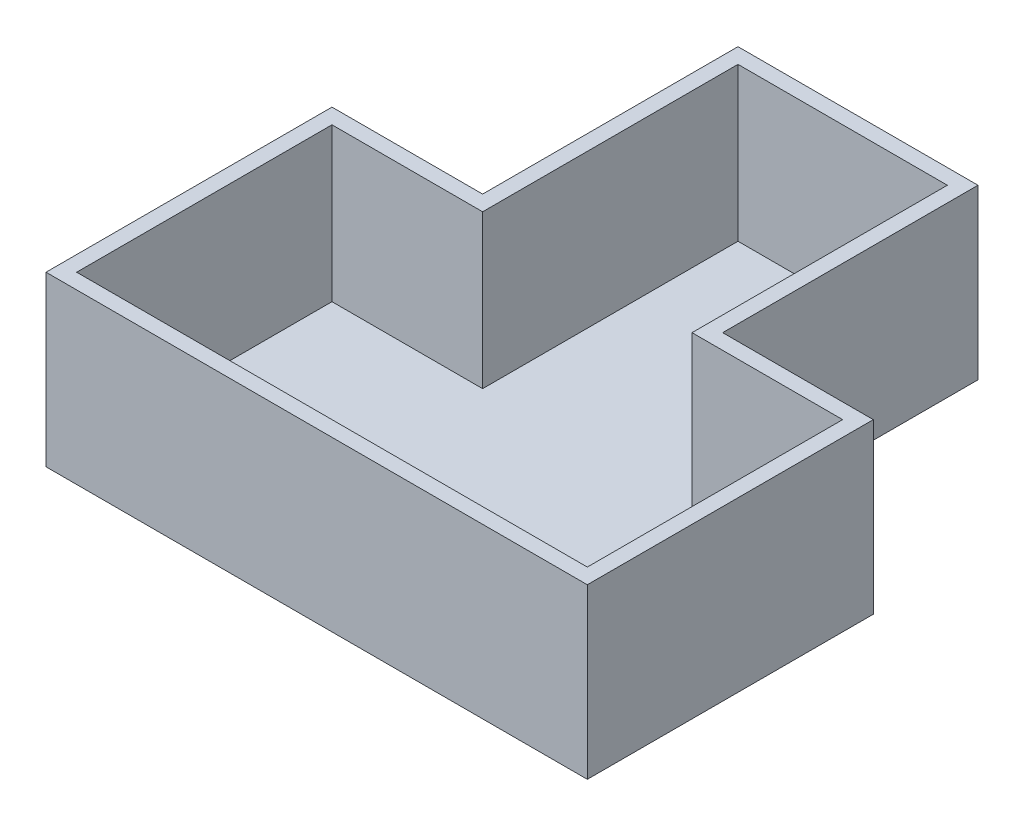
ISO-10303-21;
HEADER;
FILE_DESCRIPTION(('STEP AP214'),'2;1');
FILE_NAME('part.step','',(''),(''),'','','');
FILE_SCHEMA(('AUTOMOTIVE_DESIGN { 1 0 10303 214 1 1 1 1 }'));
ENDSEC;
DATA;
#1=APPLICATION_CONTEXT('core data for automotive mechanical design processes');
#2=APPLICATION_PROTOCOL_DEFINITION('international standard','automotive_design',2000,#1);
#3=PRODUCT_CONTEXT('',#1,'mechanical');
#4=PRODUCT('Part','Part','',(#3));
#5=PRODUCT_RELATED_PRODUCT_CATEGORY('part','',(#4));
#6=PRODUCT_DEFINITION_FORMATION('','',#4);
#7=PRODUCT_DEFINITION_CONTEXT('part definition',#1,'design');
#8=PRODUCT_DEFINITION('design','',#6,#7);
#9=PRODUCT_DEFINITION_SHAPE('','',#8);
#10=(LENGTH_UNIT() NAMED_UNIT(*) SI_UNIT(.MILLI.,.METRE.));
#11=(NAMED_UNIT(*) PLANE_ANGLE_UNIT() SI_UNIT($,.RADIAN.));
#12=(NAMED_UNIT(*) SI_UNIT($,.STERADIAN.) SOLID_ANGLE_UNIT());
#13=UNCERTAINTY_MEASURE_WITH_UNIT(LENGTH_MEASURE(1.E-05),#10,'distance_accuracy_value','');
#14=(GEOMETRIC_REPRESENTATION_CONTEXT(3) GLOBAL_UNCERTAINTY_ASSIGNED_CONTEXT((#13)) GLOBAL_UNIT_ASSIGNED_CONTEXT((#10,
#11,#12)) REPRESENTATION_CONTEXT('',''));
#15=CARTESIAN_POINT('',(0.,0.,0.));
#16=DIRECTION('',(0.,0.,1.));
#17=DIRECTION('',(1.,0.,0.));
#18=AXIS2_PLACEMENT_3D('',#15,#16,#17);
#19=CARTESIAN_POINT('',(-20.5,30.,-1.99404761904756));
#20=DIRECTION('',(0.,0.,1.));
#21=DIRECTION('',(1.,0.,0.));
#22=AXIS2_PLACEMENT_3D('',#19,#20,#21);
#23=PLANE('',#22);
#24=DIRECTION('',(-1.,0.,0.));
#25=VECTOR('',#24,1.);
#26=CARTESIAN_POINT('',(-20.5,-3.,-1.99404761904756));
#27=LINE('',#26,#25);
#28=CARTESIAN_POINT('',(-23.5,-3.,-1.99404761904756));
#29=VERTEX_POINT('',#28);
#30=CARTESIAN_POINT('',(-53.,-3.,-1.99404761904755));
#31=VERTEX_POINT('',#30);
#32=EDGE_CURVE('E169',#29,#31,#27,.T.);
#33=ORIENTED_EDGE('',*,*,#32,.T.);
#34=DIRECTION('',(0.,-1.,0.));
#35=VECTOR('',#34,1.);
#36=CARTESIAN_POINT('',(-53.,30.,-1.99404761904755));
#37=LINE('',#36,#35);
#38=CARTESIAN_POINT('',(-53.,30.,-1.99404761904755));
#39=VERTEX_POINT('',#38);
#40=EDGE_CURVE('E11',#39,#31,#37,.T.);
#41=ORIENTED_EDGE('',*,*,#40,.F.);
#42=DIRECTION('',(-1.,0.,0.));
#43=VECTOR('',#42,1.);
#44=CARTESIAN_POINT('',(-20.5,30.,-1.99404761904756));
#45=LINE('',#44,#43);
#46=CARTESIAN_POINT('',(-23.5,30.,-1.99404761904756));
#47=VERTEX_POINT('',#46);
#48=EDGE_CURVE('E254',#47,#39,#45,.T.);
#49=ORIENTED_EDGE('',*,*,#48,.F.);
#50=DIRECTION('',(0.,-1.,0.));
#51=VECTOR('',#50,1.);
#52=CARTESIAN_POINT('',(-23.5,30.,-1.99404761904756));
#53=LINE('',#52,#51);
#54=EDGE_CURVE('E221',#47,#29,#53,.T.);
#55=ORIENTED_EDGE('',*,*,#54,.T.);
#56=EDGE_LOOP('',(#33,#41,#49,#55));
#57=FACE_BOUND('',#56,.T.);
#58=ADVANCED_FACE('F33',(#57),#23,.F.);
#59=CARTESIAN_POINT('',(-53.,30.,1.00595238095245));
#60=DIRECTION('',(1.,0.,0.));
#61=DIRECTION('',(0.,0.,-1.));
#62=AXIS2_PLACEMENT_3D('',#59,#60,#61);
#63=PLANE('',#62);
#64=DIRECTION('',(0.,0.,1.));
#65=VECTOR('',#64,1.);
#66=CARTESIAN_POINT('',(-53.,-3.,1.00595238095245));
#67=LINE('',#66,#65);
#68=CARTESIAN_POINT('',(-53.,-3.,54.0059523809525));
#69=VERTEX_POINT('',#68);
#70=EDGE_CURVE('E219',#31,#69,#67,.T.);
#71=ORIENTED_EDGE('',*,*,#70,.T.);
#72=DIRECTION('',(0.,-1.,0.));
#73=VECTOR('',#72,1.);
#74=CARTESIAN_POINT('',(-53.,30.,54.0059523809525));
#75=LINE('',#74,#73);
#76=CARTESIAN_POINT('',(-53.,30.,54.0059523809525));
#77=VERTEX_POINT('',#76);
#78=EDGE_CURVE('E42',#77,#69,#75,.T.);
#79=ORIENTED_EDGE('',*,*,#78,.F.);
#80=DIRECTION('',(0.,0.,1.));
#81=VECTOR('',#80,1.);
#82=CARTESIAN_POINT('',(-53.,30.,1.00595238095245));
#83=LINE('',#82,#81);
#84=EDGE_CURVE('E256',#39,#77,#83,.T.);
#85=ORIENTED_EDGE('',*,*,#84,.F.);
#86=ORIENTED_EDGE('',*,*,#40,.T.);
#87=EDGE_LOOP('',(#71,#79,#85,#86));
#88=FACE_BOUND('',#87,.T.);
#89=ADVANCED_FACE('F284',(#88),#63,.F.);
#90=CARTESIAN_POINT('',(-50.,30.,54.0059523809525));
#91=DIRECTION('',(0.,0.,-1.));
#92=DIRECTION('',(-1.,0.,0.));
#93=AXIS2_PLACEMENT_3D('',#90,#91,#92);
#94=PLANE('',#93);
#95=DIRECTION('',(1.,0.,0.));
#96=VECTOR('',#95,1.);
#97=CARTESIAN_POINT('',(-50.,-3.,54.0059523809525));
#98=LINE('',#97,#96);
#99=CARTESIAN_POINT('',(53.,-3.,54.0059523809524));
#100=VERTEX_POINT('',#99);
#101=EDGE_CURVE('E226',#69,#100,#98,.T.);
#102=ORIENTED_EDGE('',*,*,#101,.T.);
#103=DIRECTION('',(0.,-1.,0.));
#104=VECTOR('',#103,1.);
#105=CARTESIAN_POINT('',(53.,30.,54.0059523809524));
#106=LINE('',#105,#104);
#107=CARTESIAN_POINT('',(53.,30.,54.0059523809524));
#108=VERTEX_POINT('',#107);
#109=EDGE_CURVE('E229',#108,#100,#106,.T.);
#110=ORIENTED_EDGE('',*,*,#109,.F.);
#111=DIRECTION('',(1.,0.,0.));
#112=VECTOR('',#111,1.);
#113=CARTESIAN_POINT('',(-50.,30.,54.0059523809525));
#114=LINE('',#113,#112);
#115=EDGE_CURVE('E258',#77,#108,#114,.T.);
#116=ORIENTED_EDGE('',*,*,#115,.F.);
#117=ORIENTED_EDGE('',*,*,#78,.T.);
#118=EDGE_LOOP('',(#102,#110,#116,#117));
#119=FACE_BOUND('',#118,.T.);
#120=ADVANCED_FACE('F287',(#119),#94,.F.);
#121=CARTESIAN_POINT('',(53.,30.,1.00595238095243));
#122=DIRECTION('',(-1.,0.,0.));
#123=DIRECTION('',(0.,0.,1.));
#124=AXIS2_PLACEMENT_3D('',#121,#122,#123);
#125=PLANE('',#124);
#126=DIRECTION('',(0.,0.,-1.));
#127=VECTOR('',#126,1.);
#128=CARTESIAN_POINT('',(53.,-3.,1.00595238095243));
#129=LINE('',#128,#127);
#130=CARTESIAN_POINT('',(53.,-3.,-1.99404761904757));
#131=VERTEX_POINT('',#130);
#132=EDGE_CURVE('E231',#100,#131,#129,.T.);
#133=ORIENTED_EDGE('',*,*,#132,.T.);
#134=DIRECTION('',(0.,-1.,0.));
#135=VECTOR('',#134,1.);
#136=CARTESIAN_POINT('',(53.,30.,-1.99404761904757));
#137=LINE('',#136,#135);
#138=CARTESIAN_POINT('',(53.,30.,-1.99404761904757));
#139=VERTEX_POINT('',#138);
#140=EDGE_CURVE('E234',#139,#131,#137,.T.);
#141=ORIENTED_EDGE('',*,*,#140,.F.);
#142=DIRECTION('',(0.,0.,-1.));
#143=VECTOR('',#142,1.);
#144=CARTESIAN_POINT('',(53.,30.,1.00595238095243));
#145=LINE('',#144,#143);
#146=EDGE_CURVE('E260',#108,#139,#145,.T.);
#147=ORIENTED_EDGE('',*,*,#146,.F.);
#148=ORIENTED_EDGE('',*,*,#109,.T.);
#149=EDGE_LOOP('',(#133,#141,#147,#148));
#150=FACE_BOUND('',#149,.T.);
#151=ADVANCED_FACE('F292',(#150),#125,.F.);
#152=CARTESIAN_POINT('',(20.5,30.,-1.99404761904756));
#153=DIRECTION('',(0.,0.,1.));
#154=DIRECTION('',(1.,0.,0.));
#155=AXIS2_PLACEMENT_3D('',#152,#153,#154);
#156=PLANE('',#155);
#157=DIRECTION('',(-1.,0.,0.));
#158=VECTOR('',#157,1.);
#159=CARTESIAN_POINT('',(20.5,-3.,-1.99404761904756));
#160=LINE('',#159,#158);
#161=CARTESIAN_POINT('',(23.5,-3.,-1.99404761904756));
#162=VERTEX_POINT('',#161);
#163=EDGE_CURVE('E236',#131,#162,#160,.T.);
#164=ORIENTED_EDGE('',*,*,#163,.T.);
#165=DIRECTION('',(0.,-1.,0.));
#166=VECTOR('',#165,1.);
#167=CARTESIAN_POINT('',(23.5,30.,-1.99404761904756));
#168=LINE('',#167,#166);
#169=CARTESIAN_POINT('',(23.5,30.,-1.99404761904756));
#170=VERTEX_POINT('',#169);
#171=EDGE_CURVE('E239',#170,#162,#168,.T.);
#172=ORIENTED_EDGE('',*,*,#171,.F.);
#173=DIRECTION('',(-1.,0.,0.));
#174=VECTOR('',#173,1.);
#175=CARTESIAN_POINT('',(20.5,30.,-1.99404761904756));
#176=LINE('',#175,#174);
#177=EDGE_CURVE('E262',#139,#170,#176,.T.);
#178=ORIENTED_EDGE('',*,*,#177,.F.);
#179=ORIENTED_EDGE('',*,*,#140,.T.);
#180=EDGE_LOOP('',(#164,#172,#178,#179));
#181=FACE_BOUND('',#180,.T.);
#182=ADVANCED_FACE('F296',(#181),#156,.F.);
#183=CARTESIAN_POINT('',(23.5,30.,-48.9940476190476));
#184=DIRECTION('',(-1.,0.,0.));
#185=DIRECTION('',(0.,0.,1.));
#186=AXIS2_PLACEMENT_3D('',#183,#184,#185);
#187=PLANE('',#186);
#188=DIRECTION('',(0.,0.,-1.));
#189=VECTOR('',#188,1.);
#190=CARTESIAN_POINT('',(23.5,-3.,-48.9940476190476));
#191=LINE('',#190,#189);
#192=CARTESIAN_POINT('',(23.5,-3.,-51.9940476190476));
#193=VERTEX_POINT('',#192);
#194=EDGE_CURVE('E241',#162,#193,#191,.T.);
#195=ORIENTED_EDGE('',*,*,#194,.T.);
#196=DIRECTION('',(0.,-1.,0.));
#197=VECTOR('',#196,1.);
#198=CARTESIAN_POINT('',(23.5,30.,-51.9940476190476));
#199=LINE('',#198,#197);
#200=CARTESIAN_POINT('',(23.5,30.,-51.9940476190476));
#201=VERTEX_POINT('',#200);
#202=EDGE_CURVE('E244',#201,#193,#199,.T.);
#203=ORIENTED_EDGE('',*,*,#202,.F.);
#204=DIRECTION('',(0.,0.,-1.));
#205=VECTOR('',#204,1.);
#206=CARTESIAN_POINT('',(23.5,30.,-48.9940476190476));
#207=LINE('',#206,#205);
#208=EDGE_CURVE('E264',#170,#201,#207,.T.);
#209=ORIENTED_EDGE('',*,*,#208,.F.);
#210=ORIENTED_EDGE('',*,*,#171,.T.);
#211=EDGE_LOOP('',(#195,#203,#209,#210));
#212=FACE_BOUND('',#211,.T.);
#213=ADVANCED_FACE('F300',(#212),#187,.F.);
#214=CARTESIAN_POINT('',(20.5,30.,-51.9940476190476));
#215=DIRECTION('',(0.,0.,1.));
#216=DIRECTION('',(1.,0.,0.));
#217=AXIS2_PLACEMENT_3D('',#214,#215,#216);
#218=PLANE('',#217);
#219=DIRECTION('',(-1.,0.,0.));
#220=VECTOR('',#219,1.);
#221=CARTESIAN_POINT('',(20.5,-3.,-51.9940476190476));
#222=LINE('',#221,#220);
#223=CARTESIAN_POINT('',(-23.5,-3.,-51.9940476190476));
#224=VERTEX_POINT('',#223);
#225=EDGE_CURVE('E246',#193,#224,#222,.T.);
#226=ORIENTED_EDGE('',*,*,#225,.T.);
#227=DIRECTION('',(0.,-1.,0.));
#228=VECTOR('',#227,1.);
#229=CARTESIAN_POINT('',(-23.5,30.,-51.9940476190476));
#230=LINE('',#229,#228);
#231=CARTESIAN_POINT('',(-23.5,30.,-51.9940476190476));
#232=VERTEX_POINT('',#231);
#233=EDGE_CURVE('E224',#232,#224,#230,.T.);
#234=ORIENTED_EDGE('',*,*,#233,.F.);
#235=DIRECTION('',(-1.,0.,0.));
#236=VECTOR('',#235,1.);
#237=CARTESIAN_POINT('',(20.5,30.,-51.9940476190476));
#238=LINE('',#237,#236);
#239=EDGE_CURVE('E265',#201,#232,#238,.T.);
#240=ORIENTED_EDGE('',*,*,#239,.F.);
#241=ORIENTED_EDGE('',*,*,#202,.T.);
#242=EDGE_LOOP('',(#226,#234,#240,#241));
#243=FACE_BOUND('',#242,.T.);
#244=ADVANCED_FACE('F271',(#243),#218,.F.);
#245=CARTESIAN_POINT('',(-23.5,30.,-48.9940476190476));
#246=DIRECTION('',(1.,0.,0.));
#247=DIRECTION('',(0.,0.,-1.));
#248=AXIS2_PLACEMENT_3D('',#245,#246,#247);
#249=PLANE('',#248);
#250=DIRECTION('',(0.,0.,1.));
#251=VECTOR('',#250,1.);
#252=CARTESIAN_POINT('',(-23.5,-3.,-48.9940476190476));
#253=LINE('',#252,#251);
#254=EDGE_CURVE('E250',#224,#29,#253,.T.);
#255=ORIENTED_EDGE('',*,*,#254,.T.);
#256=ORIENTED_EDGE('',*,*,#54,.F.);
#257=DIRECTION('',(0.,0.,1.));
#258=VECTOR('',#257,1.);
#259=CARTESIAN_POINT('',(-23.5,30.,-48.9940476190476));
#260=LINE('',#259,#258);
#261=EDGE_CURVE('E37',#232,#47,#260,.T.);
#262=ORIENTED_EDGE('',*,*,#261,.F.);
#263=ORIENTED_EDGE('',*,*,#233,.T.);
#264=EDGE_LOOP('',(#255,#256,#262,#263));
#265=FACE_BOUND('',#264,.T.);
#266=ADVANCED_FACE('F275',(#265),#249,.F.);
#267=CARTESIAN_POINT('',(0.,30.,0.));
#268=DIRECTION('',(0.,1.,0.));
#269=DIRECTION('',(0.,0.,1.));
#270=AXIS2_PLACEMENT_3D('',#267,#268,#269);
#271=PLANE('',#270);
#272=DIRECTION('',(-1.,0.,0.));
#273=VECTOR('',#272,1.);
#274=CARTESIAN_POINT('',(-20.5,30.,1.00595238095244));
#275=LINE('',#274,#273);
#276=CARTESIAN_POINT('',(-20.5,30.,1.00595238095244));
#277=VERTEX_POINT('',#276);
#278=CARTESIAN_POINT('',(-50.,30.,1.00595238095245));
#279=VERTEX_POINT('',#278);
#280=EDGE_CURVE('E150',#277,#279,#275,.T.);
#281=ORIENTED_EDGE('',*,*,#280,.F.);
#282=DIRECTION('',(0.,0.,1.));
#283=VECTOR('',#282,1.);
#284=CARTESIAN_POINT('',(-20.5,30.,-48.9940476190476));
#285=LINE('',#284,#283);
#286=CARTESIAN_POINT('',(-20.5,30.,-48.9940476190476));
#287=VERTEX_POINT('',#286);
#288=EDGE_CURVE('E187',#287,#277,#285,.T.);
#289=ORIENTED_EDGE('',*,*,#288,.F.);
#290=DIRECTION('',(-1.,0.,0.));
#291=VECTOR('',#290,1.);
#292=CARTESIAN_POINT('',(20.5,30.,-48.9940476190476));
#293=LINE('',#292,#291);
#294=CARTESIAN_POINT('',(20.5,30.,-48.9940476190476));
#295=VERTEX_POINT('',#294);
#296=EDGE_CURVE('E185',#295,#287,#293,.T.);
#297=ORIENTED_EDGE('',*,*,#296,.F.);
#298=DIRECTION('',(0.,0.,-1.));
#299=VECTOR('',#298,1.);
#300=CARTESIAN_POINT('',(20.5,30.,-48.9940476190476));
#301=LINE('',#300,#299);
#302=CARTESIAN_POINT('',(20.5,30.,1.00595238095244));
#303=VERTEX_POINT('',#302);
#304=EDGE_CURVE('E183',#303,#295,#301,.T.);
#305=ORIENTED_EDGE('',*,*,#304,.F.);
#306=DIRECTION('',(-1.,0.,0.));
#307=VECTOR('',#306,1.);
#308=CARTESIAN_POINT('',(20.5,30.,1.00595238095244));
#309=LINE('',#308,#307);
#310=CARTESIAN_POINT('',(50.,30.,1.00595238095243));
#311=VERTEX_POINT('',#310);
#312=EDGE_CURVE('E181',#311,#303,#309,.T.);
#313=ORIENTED_EDGE('',*,*,#312,.F.);
#314=DIRECTION('',(0.,0.,-1.));
#315=VECTOR('',#314,1.);
#316=CARTESIAN_POINT('',(50.,30.,1.00595238095243));
#317=LINE('',#316,#315);
#318=CARTESIAN_POINT('',(50.,30.,51.0059523809524));
#319=VERTEX_POINT('',#318);
#320=EDGE_CURVE('E177',#319,#311,#317,.T.);
#321=ORIENTED_EDGE('',*,*,#320,.F.);
#322=DIRECTION('',(1.,0.,0.));
#323=VECTOR('',#322,1.);
#324=CARTESIAN_POINT('',(-50.,30.,51.0059523809525));
#325=LINE('',#324,#323);
#326=CARTESIAN_POINT('',(-50.,30.,51.0059523809525));
#327=VERTEX_POINT('',#326);
#328=EDGE_CURVE('E175',#327,#319,#325,.T.);
#329=ORIENTED_EDGE('',*,*,#328,.F.);
#330=DIRECTION('',(0.,0.,1.));
#331=VECTOR('',#330,1.);
#332=CARTESIAN_POINT('',(-50.,30.,1.00595238095245));
#333=LINE('',#332,#331);
#334=EDGE_CURVE('E161',#279,#327,#333,.T.);
#335=ORIENTED_EDGE('',*,*,#334,.F.);
#336=EDGE_LOOP('',(#281,#289,#297,#305,#313,#321,#329,#335));
#337=FACE_BOUND('',#336,.T.);
#338=ORIENTED_EDGE('',*,*,#48,.T.);
#339=ORIENTED_EDGE('',*,*,#84,.T.);
#340=ORIENTED_EDGE('',*,*,#115,.T.);
#341=ORIENTED_EDGE('',*,*,#146,.T.);
#342=ORIENTED_EDGE('',*,*,#177,.T.);
#343=ORIENTED_EDGE('',*,*,#208,.T.);
#344=ORIENTED_EDGE('',*,*,#239,.T.);
#345=ORIENTED_EDGE('',*,*,#261,.T.);
#346=EDGE_LOOP('',(#338,#339,#340,#341,#342,#343,#344,#345));
#347=FACE_BOUND('',#346,.T.);
#348=ADVANCED_FACE('F173',(#337,#347),#271,.T.);
#349=CARTESIAN_POINT('',(0.,-3.,0.));
#350=DIRECTION('',(0.,1.,0.));
#351=DIRECTION('',(0.,0.,1.));
#352=AXIS2_PLACEMENT_3D('',#349,#350,#351);
#353=PLANE('',#352);
#354=ORIENTED_EDGE('',*,*,#32,.F.);
#355=ORIENTED_EDGE('',*,*,#254,.F.);
#356=ORIENTED_EDGE('',*,*,#225,.F.);
#357=ORIENTED_EDGE('',*,*,#194,.F.);
#358=ORIENTED_EDGE('',*,*,#163,.F.);
#359=ORIENTED_EDGE('',*,*,#132,.F.);
#360=ORIENTED_EDGE('',*,*,#101,.F.);
#361=ORIENTED_EDGE('',*,*,#70,.F.);
#362=EDGE_LOOP('',(#354,#355,#356,#357,#358,#359,#360,#361));
#363=FACE_BOUND('',#362,.T.);
#364=ADVANCED_FACE('F35',(#363),#353,.F.);
#365=CARTESIAN_POINT('',(-20.5,30.,1.00595238095244));
#366=DIRECTION('',(0.,0.,1.));
#367=DIRECTION('',(1.,0.,0.));
#368=AXIS2_PLACEMENT_3D('',#365,#366,#367);
#369=PLANE('',#368);
#370=DIRECTION('',(-1.,0.,0.));
#371=VECTOR('',#370,1.);
#372=CARTESIAN_POINT('',(-20.5,0.,1.00595238095244));
#373=LINE('',#372,#371);
#374=CARTESIAN_POINT('',(-20.5,0.,1.00595238095244));
#375=VERTEX_POINT('',#374);
#376=CARTESIAN_POINT('',(-50.,0.,1.00595238095245));
#377=VERTEX_POINT('',#376);
#378=EDGE_CURVE('E189',#375,#377,#373,.T.);
#379=ORIENTED_EDGE('',*,*,#378,.F.);
#380=DIRECTION('',(0.,-1.,0.));
#381=VECTOR('',#380,1.);
#382=CARTESIAN_POINT('',(-20.5,30.,1.00595238095244));
#383=LINE('',#382,#381);
#384=EDGE_CURVE('E157',#277,#375,#383,.T.);
#385=ORIENTED_EDGE('',*,*,#384,.F.);
#386=ORIENTED_EDGE('',*,*,#280,.T.);
#387=DIRECTION('',(0.,-1.,0.));
#388=VECTOR('',#387,1.);
#389=CARTESIAN_POINT('',(-50.,30.,1.00595238095245));
#390=LINE('',#389,#388);
#391=EDGE_CURVE('E154',#279,#377,#390,.T.);
#392=ORIENTED_EDGE('',*,*,#391,.T.);
#393=EDGE_LOOP('',(#379,#385,#386,#392));
#394=FACE_BOUND('',#393,.T.);
#395=ADVANCED_FACE('F153',(#394),#369,.T.);
#396=CARTESIAN_POINT('',(-50.,30.,1.00595238095245));
#397=DIRECTION('',(1.,0.,0.));
#398=DIRECTION('',(0.,0.,-1.));
#399=AXIS2_PLACEMENT_3D('',#396,#397,#398);
#400=PLANE('',#399);
#401=DIRECTION('',(0.,0.,1.));
#402=VECTOR('',#401,1.);
#403=CARTESIAN_POINT('',(-50.,0.,1.00595238095245));
#404=LINE('',#403,#402);
#405=CARTESIAN_POINT('',(-50.,0.,51.0059523809525));
#406=VERTEX_POINT('',#405);
#407=EDGE_CURVE('E168',#377,#406,#404,.T.);
#408=ORIENTED_EDGE('',*,*,#407,.F.);
#409=ORIENTED_EDGE('',*,*,#391,.F.);
#410=ORIENTED_EDGE('',*,*,#334,.T.);
#411=DIRECTION('',(0.,-1.,0.));
#412=VECTOR('',#411,1.);
#413=CARTESIAN_POINT('',(-50.,30.,51.0059523809525));
#414=LINE('',#413,#412);
#415=EDGE_CURVE('E170',#327,#406,#414,.T.);
#416=ORIENTED_EDGE('',*,*,#415,.T.);
#417=EDGE_LOOP('',(#408,#409,#410,#416));
#418=FACE_BOUND('',#417,.T.);
#419=ADVANCED_FACE('F165',(#418),#400,.T.);
#420=CARTESIAN_POINT('',(-50.,30.,51.0059523809525));
#421=DIRECTION('',(0.,0.,-1.));
#422=DIRECTION('',(-1.,0.,0.));
#423=AXIS2_PLACEMENT_3D('',#420,#421,#422);
#424=PLANE('',#423);
#425=DIRECTION('',(1.,0.,0.));
#426=VECTOR('',#425,1.);
#427=CARTESIAN_POINT('',(-50.,0.,51.0059523809525));
#428=LINE('',#427,#426);
#429=CARTESIAN_POINT('',(50.,0.,51.0059523809524));
#430=VERTEX_POINT('',#429);
#431=EDGE_CURVE('E192',#406,#430,#428,.T.);
#432=ORIENTED_EDGE('',*,*,#431,.F.);
#433=ORIENTED_EDGE('',*,*,#415,.F.);
#434=ORIENTED_EDGE('',*,*,#328,.T.);
#435=DIRECTION('',(0.,-1.,0.));
#436=VECTOR('',#435,1.);
#437=CARTESIAN_POINT('',(50.,30.,51.0059523809524));
#438=LINE('',#437,#436);
#439=EDGE_CURVE('E214',#319,#430,#438,.T.);
#440=ORIENTED_EDGE('',*,*,#439,.T.);
#441=EDGE_LOOP('',(#432,#433,#434,#440));
#442=FACE_BOUND('',#441,.T.);
#443=ADVANCED_FACE('F353',(#442),#424,.T.);
#444=CARTESIAN_POINT('',(50.,30.,1.00595238095243));
#445=DIRECTION('',(-1.,0.,0.));
#446=DIRECTION('',(0.,0.,1.));
#447=AXIS2_PLACEMENT_3D('',#444,#445,#446);
#448=PLANE('',#447);
#449=DIRECTION('',(0.,0.,-1.));
#450=VECTOR('',#449,1.);
#451=CARTESIAN_POINT('',(50.,0.,1.00595238095243));
#452=LINE('',#451,#450);
#453=CARTESIAN_POINT('',(50.,0.,1.00595238095243));
#454=VERTEX_POINT('',#453);
#455=EDGE_CURVE('E194',#430,#454,#452,.T.);
#456=ORIENTED_EDGE('',*,*,#455,.F.);
#457=ORIENTED_EDGE('',*,*,#439,.F.);
#458=ORIENTED_EDGE('',*,*,#320,.T.);
#459=DIRECTION('',(0.,-1.,0.));
#460=VECTOR('',#459,1.);
#461=CARTESIAN_POINT('',(50.,30.,1.00595238095243));
#462=LINE('',#461,#460);
#463=EDGE_CURVE('E211',#311,#454,#462,.T.);
#464=ORIENTED_EDGE('',*,*,#463,.T.);
#465=EDGE_LOOP('',(#456,#457,#458,#464));
#466=FACE_BOUND('',#465,.T.);
#467=ADVANCED_FACE('F362',(#466),#448,.T.);
#468=CARTESIAN_POINT('',(20.5,30.,1.00595238095244));
#469=DIRECTION('',(0.,0.,1.));
#470=DIRECTION('',(1.,0.,0.));
#471=AXIS2_PLACEMENT_3D('',#468,#469,#470);
#472=PLANE('',#471);
#473=DIRECTION('',(-1.,0.,0.));
#474=VECTOR('',#473,1.);
#475=CARTESIAN_POINT('',(20.5,0.,1.00595238095244));
#476=LINE('',#475,#474);
#477=CARTESIAN_POINT('',(20.5,0.,1.00595238095244));
#478=VERTEX_POINT('',#477);
#479=EDGE_CURVE('E196',#454,#478,#476,.T.);
#480=ORIENTED_EDGE('',*,*,#479,.F.);
#481=ORIENTED_EDGE('',*,*,#463,.F.);
#482=ORIENTED_EDGE('',*,*,#312,.T.);
#483=DIRECTION('',(0.,-1.,0.));
#484=VECTOR('',#483,1.);
#485=CARTESIAN_POINT('',(20.5,30.,1.00595238095244));
#486=LINE('',#485,#484);
#487=EDGE_CURVE('E208',#303,#478,#486,.T.);
#488=ORIENTED_EDGE('',*,*,#487,.T.);
#489=EDGE_LOOP('',(#480,#481,#482,#488));
#490=FACE_BOUND('',#489,.T.);
#491=ADVANCED_FACE('F372',(#490),#472,.T.);
#492=CARTESIAN_POINT('',(20.5,30.,-48.9940476190476));
#493=DIRECTION('',(-1.,0.,0.));
#494=DIRECTION('',(0.,0.,1.));
#495=AXIS2_PLACEMENT_3D('',#492,#493,#494);
#496=PLANE('',#495);
#497=DIRECTION('',(0.,0.,-1.));
#498=VECTOR('',#497,1.);
#499=CARTESIAN_POINT('',(20.5,0.,-48.9940476190476));
#500=LINE('',#499,#498);
#501=CARTESIAN_POINT('',(20.5,0.,-48.9940476190476));
#502=VERTEX_POINT('',#501);
#503=EDGE_CURVE('E198',#478,#502,#500,.T.);
#504=ORIENTED_EDGE('',*,*,#503,.F.);
#505=ORIENTED_EDGE('',*,*,#487,.F.);
#506=ORIENTED_EDGE('',*,*,#304,.T.);
#507=DIRECTION('',(0.,-1.,0.));
#508=VECTOR('',#507,1.);
#509=CARTESIAN_POINT('',(20.5,30.,-48.9940476190476));
#510=LINE('',#509,#508);
#511=EDGE_CURVE('E205',#295,#502,#510,.T.);
#512=ORIENTED_EDGE('',*,*,#511,.T.);
#513=EDGE_LOOP('',(#504,#505,#506,#512));
#514=FACE_BOUND('',#513,.T.);
#515=ADVANCED_FACE('F382',(#514),#496,.T.);
#516=CARTESIAN_POINT('',(20.5,30.,-48.9940476190476));
#517=DIRECTION('',(0.,0.,1.));
#518=DIRECTION('',(1.,0.,0.));
#519=AXIS2_PLACEMENT_3D('',#516,#517,#518);
#520=PLANE('',#519);
#521=DIRECTION('',(-1.,0.,0.));
#522=VECTOR('',#521,1.);
#523=CARTESIAN_POINT('',(20.5,0.,-48.9940476190476));
#524=LINE('',#523,#522);
#525=CARTESIAN_POINT('',(-20.5,0.,-48.9940476190476));
#526=VERTEX_POINT('',#525);
#527=EDGE_CURVE('E200',#502,#526,#524,.T.);
#528=ORIENTED_EDGE('',*,*,#527,.F.);
#529=ORIENTED_EDGE('',*,*,#511,.F.);
#530=ORIENTED_EDGE('',*,*,#296,.T.);
#531=DIRECTION('',(0.,-1.,0.));
#532=VECTOR('',#531,1.);
#533=CARTESIAN_POINT('',(-20.5,30.,-48.9940476190476));
#534=LINE('',#533,#532);
#535=EDGE_CURVE('E50',#287,#526,#534,.T.);
#536=ORIENTED_EDGE('',*,*,#535,.T.);
#537=EDGE_LOOP('',(#528,#529,#530,#536));
#538=FACE_BOUND('',#537,.T.);
#539=ADVANCED_FACE('F392',(#538),#520,.T.);
#540=CARTESIAN_POINT('',(-20.5,30.,-48.9940476190476));
#541=DIRECTION('',(1.,0.,0.));
#542=DIRECTION('',(0.,0.,-1.));
#543=AXIS2_PLACEMENT_3D('',#540,#541,#542);
#544=PLANE('',#543);
#545=DIRECTION('',(0.,0.,1.));
#546=VECTOR('',#545,1.);
#547=CARTESIAN_POINT('',(-20.5,0.,-48.9940476190476));
#548=LINE('',#547,#546);
#549=EDGE_CURVE('E162',#526,#375,#548,.T.);
#550=ORIENTED_EDGE('',*,*,#549,.F.);
#551=ORIENTED_EDGE('',*,*,#535,.F.);
#552=ORIENTED_EDGE('',*,*,#288,.T.);
#553=ORIENTED_EDGE('',*,*,#384,.T.);
#554=EDGE_LOOP('',(#550,#551,#552,#553));
#555=FACE_BOUND('',#554,.T.);
#556=ADVANCED_FACE('F402',(#555),#544,.T.);
#557=CARTESIAN_POINT('',(0.,0.,0.));
#558=DIRECTION('',(0.,1.,0.));
#559=DIRECTION('',(0.,0.,1.));
#560=AXIS2_PLACEMENT_3D('',#557,#558,#559);
#561=PLANE('',#560);
#562=ORIENTED_EDGE('',*,*,#378,.T.);
#563=ORIENTED_EDGE('',*,*,#407,.T.);
#564=ORIENTED_EDGE('',*,*,#431,.T.);
#565=ORIENTED_EDGE('',*,*,#455,.T.);
#566=ORIENTED_EDGE('',*,*,#479,.T.);
#567=ORIENTED_EDGE('',*,*,#503,.T.);
#568=ORIENTED_EDGE('',*,*,#527,.T.);
#569=ORIENTED_EDGE('',*,*,#549,.T.);
#570=EDGE_LOOP('',(#562,#563,#564,#565,#566,#567,#568,#569));
#571=FACE_BOUND('',#570,.T.);
#572=ADVANCED_FACE('F412',(#571),#561,.T.);
#573=CLOSED_SHELL('',(#58,#89,#120,#151,#182,#213,#244,#266,#348,#364,#395,#419,#443,#467,#491,
#515,#539,#556,#572));
#574=MANIFOLD_SOLID_BREP('B2',#573);
#575=ADVANCED_BREP_SHAPE_REPRESENTATION('',(#18,#574),#14);
#576=SHAPE_DEFINITION_REPRESENTATION(#9,#575);
ENDSEC;
END-ISO-10303-21;
